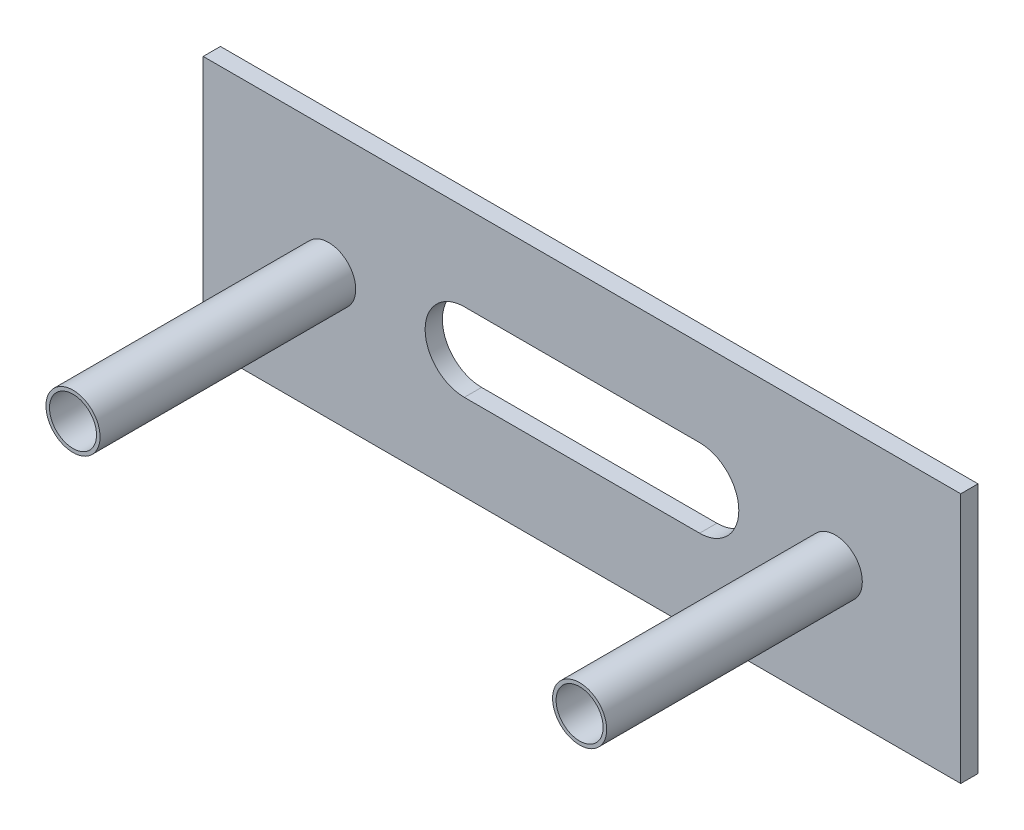
ISO-10303-21;
HEADER;
FILE_DESCRIPTION(('STEP AP214'),'2;1');
FILE_NAME('part.step','',(''),(''),'','','');
FILE_SCHEMA(('AUTOMOTIVE_DESIGN { 1 0 10303 214 1 1 1 1 }'));
ENDSEC;
DATA;
#1=APPLICATION_CONTEXT('core data for automotive mechanical design processes');
#2=APPLICATION_PROTOCOL_DEFINITION('international standard','automotive_design',2000,#1);
#3=PRODUCT_CONTEXT('',#1,'mechanical');
#4=PRODUCT('Part','Part','',(#3));
#5=PRODUCT_RELATED_PRODUCT_CATEGORY('part','',(#4));
#6=PRODUCT_DEFINITION_FORMATION('','',#4);
#7=PRODUCT_DEFINITION_CONTEXT('part definition',#1,'design');
#8=PRODUCT_DEFINITION('design','',#6,#7);
#9=PRODUCT_DEFINITION_SHAPE('','',#8);
#10=(LENGTH_UNIT() NAMED_UNIT(*) SI_UNIT(.MILLI.,.METRE.));
#11=(NAMED_UNIT(*) PLANE_ANGLE_UNIT() SI_UNIT($,.RADIAN.));
#12=(NAMED_UNIT(*) SI_UNIT($,.STERADIAN.) SOLID_ANGLE_UNIT());
#13=UNCERTAINTY_MEASURE_WITH_UNIT(LENGTH_MEASURE(1.E-05),#10,'distance_accuracy_value','');
#14=(GEOMETRIC_REPRESENTATION_CONTEXT(3) GLOBAL_UNCERTAINTY_ASSIGNED_CONTEXT((#13)) GLOBAL_UNIT_ASSIGNED_CONTEXT((#10,
#11,#12)) REPRESENTATION_CONTEXT('',''));
#15=CARTESIAN_POINT('',(0.,0.,0.));
#16=DIRECTION('',(0.,0.,1.));
#17=DIRECTION('',(1.,0.,0.));
#18=AXIS2_PLACEMENT_3D('',#15,#16,#17);
#19=CARTESIAN_POINT('',(-47.6288432611678,18.259938231017,2.2));
#20=DIRECTION('',(1.,0.,0.));
#21=DIRECTION('',(0.,0.,-1.));
#22=AXIS2_PLACEMENT_3D('',#19,#20,#21);
#23=PLANE('',#22);
#24=DIRECTION('',(0.,-1.,0.));
#25=VECTOR('',#24,1.);
#26=CARTESIAN_POINT('',(-47.6288432611678,18.259938231017,0.));
#27=LINE('',#26,#25);
#28=CARTESIAN_POINT('',(-47.6288432611678,18.259938231017,0.));
#29=VERTEX_POINT('',#28);
#30=CARTESIAN_POINT('',(-47.6288432611678,-13.740061768983,0.));
#31=VERTEX_POINT('',#30);
#32=EDGE_CURVE('E153',#29,#31,#27,.T.);
#33=ORIENTED_EDGE('',*,*,#32,.T.);
#34=DIRECTION('',(0.,0.,-1.));
#35=VECTOR('',#34,1.);
#36=CARTESIAN_POINT('',(-47.6288432611678,-13.740061768983,2.2));
#37=LINE('',#36,#35);
#38=CARTESIAN_POINT('',(-47.6288432611678,-13.740061768983,2.2));
#39=VERTEX_POINT('',#38);
#40=EDGE_CURVE('E11',#39,#31,#37,.T.);
#41=ORIENTED_EDGE('',*,*,#40,.F.);
#42=DIRECTION('',(0.,-1.,0.));
#43=VECTOR('',#42,1.);
#44=CARTESIAN_POINT('',(-47.6288432611678,18.259938231017,2.2));
#45=LINE('',#44,#43);
#46=CARTESIAN_POINT('',(-47.6288432611678,18.259938231017,2.2));
#47=VERTEX_POINT('',#46);
#48=EDGE_CURVE('E156',#47,#39,#45,.T.);
#49=ORIENTED_EDGE('',*,*,#48,.F.);
#50=DIRECTION('',(0.,0.,-1.));
#51=VECTOR('',#50,1.);
#52=CARTESIAN_POINT('',(-47.6288432611678,18.259938231017,2.2));
#53=LINE('',#52,#51);
#54=EDGE_CURVE('E166',#47,#29,#53,.T.);
#55=ORIENTED_EDGE('',*,*,#54,.T.);
#56=EDGE_LOOP('',(#33,#41,#49,#55));
#57=FACE_BOUND('',#56,.T.);
#58=ADVANCED_FACE('F39',(#57),#23,.F.);
#59=CARTESIAN_POINT('',(-47.6288432611678,-13.740061768983,2.2));
#60=DIRECTION('',(0.,1.,0.));
#61=DIRECTION('',(0.,0.,1.));
#62=AXIS2_PLACEMENT_3D('',#59,#60,#61);
#63=PLANE('',#62);
#64=DIRECTION('',(1.,0.,0.));
#65=VECTOR('',#64,1.);
#66=CARTESIAN_POINT('',(-47.6288432611678,-13.740061768983,0.));
#67=LINE('',#66,#65);
#68=CARTESIAN_POINT('',(48.9711567388322,-13.740061768983,0.));
#69=VERTEX_POINT('',#68);
#70=EDGE_CURVE('E169',#31,#69,#67,.T.);
#71=ORIENTED_EDGE('',*,*,#70,.T.);
#72=DIRECTION('',(0.,0.,-1.));
#73=VECTOR('',#72,1.);
#74=CARTESIAN_POINT('',(48.9711567388322,-13.740061768983,2.2));
#75=LINE('',#74,#73);
#76=CARTESIAN_POINT('',(48.9711567388322,-13.740061768983,2.2));
#77=VERTEX_POINT('',#76);
#78=EDGE_CURVE('E46',#77,#69,#75,.T.);
#79=ORIENTED_EDGE('',*,*,#78,.F.);
#80=DIRECTION('',(1.,0.,0.));
#81=VECTOR('',#80,1.);
#82=CARTESIAN_POINT('',(-47.6288432611678,-13.740061768983,2.2));
#83=LINE('',#82,#81);
#84=EDGE_CURVE('E159',#39,#77,#83,.T.);
#85=ORIENTED_EDGE('',*,*,#84,.F.);
#86=ORIENTED_EDGE('',*,*,#40,.T.);
#87=EDGE_LOOP('',(#71,#79,#85,#86));
#88=FACE_BOUND('',#87,.T.);
#89=ADVANCED_FACE('F197',(#88),#63,.F.);
#90=CARTESIAN_POINT('',(48.9711567388322,18.259938231017,2.2));
#91=DIRECTION('',(-1.,0.,0.));
#92=DIRECTION('',(0.,0.,1.));
#93=AXIS2_PLACEMENT_3D('',#90,#91,#92);
#94=PLANE('',#93);
#95=DIRECTION('',(0.,1.,0.));
#96=VECTOR('',#95,1.);
#97=CARTESIAN_POINT('',(48.9711567388322,18.259938231017,0.));
#98=LINE('',#97,#96);
#99=CARTESIAN_POINT('',(48.9711567388322,18.259938231017,0.));
#100=VERTEX_POINT('',#99);
#101=EDGE_CURVE('E171',#69,#100,#98,.T.);
#102=ORIENTED_EDGE('',*,*,#101,.T.);
#103=DIRECTION('',(0.,0.,-1.));
#104=VECTOR('',#103,1.);
#105=CARTESIAN_POINT('',(48.9711567388322,18.259938231017,2.2));
#106=LINE('',#105,#104);
#107=CARTESIAN_POINT('',(48.9711567388322,18.259938231017,2.2));
#108=VERTEX_POINT('',#107);
#109=EDGE_CURVE('E176',#108,#100,#106,.T.);
#110=ORIENTED_EDGE('',*,*,#109,.F.);
#111=DIRECTION('',(0.,1.,0.));
#112=VECTOR('',#111,1.);
#113=CARTESIAN_POINT('',(48.9711567388322,18.259938231017,2.2));
#114=LINE('',#113,#112);
#115=EDGE_CURVE('E162',#77,#108,#114,.T.);
#116=ORIENTED_EDGE('',*,*,#115,.F.);
#117=ORIENTED_EDGE('',*,*,#78,.T.);
#118=EDGE_LOOP('',(#102,#110,#116,#117));
#119=FACE_BOUND('',#118,.T.);
#120=ADVANCED_FACE('F183',(#119),#94,.F.);
#121=CARTESIAN_POINT('',(-47.6288432611678,18.259938231017,2.2));
#122=DIRECTION('',(0.,-1.,0.));
#123=DIRECTION('',(0.,0.,-1.));
#124=AXIS2_PLACEMENT_3D('',#121,#122,#123);
#125=PLANE('',#124);
#126=DIRECTION('',(-1.,0.,0.));
#127=VECTOR('',#126,1.);
#128=CARTESIAN_POINT('',(-47.6288432611678,18.259938231017,0.));
#129=LINE('',#128,#127);
#130=EDGE_CURVE('E160',#100,#29,#129,.T.);
#131=ORIENTED_EDGE('',*,*,#130,.T.);
#132=ORIENTED_EDGE('',*,*,#54,.F.);
#133=DIRECTION('',(-1.,0.,0.));
#134=VECTOR('',#133,1.);
#135=CARTESIAN_POINT('',(-47.6288432611678,18.259938231017,2.2));
#136=LINE('',#135,#134);
#137=EDGE_CURVE('E164',#108,#47,#136,.T.);
#138=ORIENTED_EDGE('',*,*,#137,.F.);
#139=ORIENTED_EDGE('',*,*,#109,.T.);
#140=EDGE_LOOP('',(#131,#132,#138,#139));
#141=FACE_BOUND('',#140,.T.);
#142=ADVANCED_FACE('F190',(#141),#125,.F.);
#143=CARTESIAN_POINT('',(0.,0.,2.2));
#144=DIRECTION('',(0.,0.,1.));
#145=DIRECTION('',(1.,0.,0.));
#146=AXIS2_PLACEMENT_3D('',#143,#144,#145);
#147=PLANE('',#146);
#148=CARTESIAN_POINT('',(-14.3288432611678,2.25993823101696,2.2));
#149=DIRECTION('',(0.,0.,1.));
#150=DIRECTION('',(1.,0.,0.));
#151=AXIS2_PLACEMENT_3D('',#148,#149,#150);
#152=CIRCLE('',#151,5.);
#153=CARTESIAN_POINT('',(-14.3288432611678,7.25993823101695,2.2));
#154=VERTEX_POINT('',#153);
#155=CARTESIAN_POINT('',(-14.3288432611678,-2.74006176898305,2.2));
#156=VERTEX_POINT('',#155);
#157=EDGE_CURVE('E109',#154,#156,#152,.T.);
#158=ORIENTED_EDGE('',*,*,#157,.F.);
#159=DIRECTION('',(-1.,0.,0.));
#160=VECTOR('',#159,1.);
#161=CARTESIAN_POINT('',(0.,7.25993823101696,2.2));
#162=LINE('',#161,#160);
#163=CARTESIAN_POINT('',(15.6711567388322,7.25993823101696,2.2));
#164=VERTEX_POINT('',#163);
#165=EDGE_CURVE('E140',#164,#154,#162,.T.);
#166=ORIENTED_EDGE('',*,*,#165,.F.);
#167=CARTESIAN_POINT('',(15.6711567388322,2.25993823101696,2.2));
#168=DIRECTION('',(0.,0.,1.));
#169=DIRECTION('',(1.,0.,0.));
#170=AXIS2_PLACEMENT_3D('',#167,#168,#169);
#171=CIRCLE('',#170,5.);
#172=CARTESIAN_POINT('',(15.6711567388322,-2.74006176898303,2.2));
#173=VERTEX_POINT('',#172);
#174=EDGE_CURVE('E137',#173,#164,#171,.T.);
#175=ORIENTED_EDGE('',*,*,#174,.F.);
#176=DIRECTION('',(1.,0.,0.));
#177=VECTOR('',#176,1.);
#178=CARTESIAN_POINT('',(0.,-2.74006176898304,2.2));
#179=LINE('',#178,#177);
#180=EDGE_CURVE('E135',#156,#173,#179,.T.);
#181=ORIENTED_EDGE('',*,*,#180,.F.);
#182=EDGE_LOOP('',(#158,#166,#175,#181));
#183=FACE_BOUND('',#182,.T.);
#184=CARTESIAN_POINT('',(32.9711567388322,2.25993823101696,2.2));
#185=DIRECTION('',(0.,0.,1.));
#186=DIRECTION('',(1.,0.,0.));
#187=AXIS2_PLACEMENT_3D('',#184,#185,#186);
#188=CIRCLE('',#187,3.45);
#189=CARTESIAN_POINT('',(36.4211567388322,2.25993823101696,2.2));
#190=VERTEX_POINT('',#189);
#191=EDGE_CURVE('E143',#190,#190,#188,.T.);
#192=ORIENTED_EDGE('',*,*,#191,.F.);
#193=EDGE_LOOP('',(#192));
#194=FACE_BOUND('',#193,.T.);
#195=CARTESIAN_POINT('',(-31.6288432611678,2.25993823101696,2.2));
#196=DIRECTION('',(0.,0.,1.));
#197=DIRECTION('',(1.,0.,0.));
#198=AXIS2_PLACEMENT_3D('',#195,#196,#197);
#199=CIRCLE('',#198,3.45);
#200=CARTESIAN_POINT('',(-28.1788432611678,2.25993823101696,2.2));
#201=VERTEX_POINT('',#200);
#202=EDGE_CURVE('E147',#201,#201,#199,.T.);
#203=ORIENTED_EDGE('',*,*,#202,.F.);
#204=EDGE_LOOP('',(#203));
#205=FACE_BOUND('',#204,.T.);
#206=ORIENTED_EDGE('',*,*,#48,.T.);
#207=ORIENTED_EDGE('',*,*,#84,.T.);
#208=ORIENTED_EDGE('',*,*,#115,.T.);
#209=ORIENTED_EDGE('',*,*,#137,.T.);
#210=EDGE_LOOP('',(#206,#207,#208,#209));
#211=FACE_BOUND('',#210,.T.);
#212=ADVANCED_FACE('F196',(#183,#194,#205,#211),#147,.T.);
#213=CARTESIAN_POINT('',(0.,0.,0.));
#214=DIRECTION('',(0.,0.,1.));
#215=DIRECTION('',(1.,0.,0.));
#216=AXIS2_PLACEMENT_3D('',#213,#214,#215);
#217=PLANE('',#216);
#218=CARTESIAN_POINT('',(-31.6288432611678,2.25993823101696,0.));
#219=DIRECTION('',(0.,0.,1.));
#220=DIRECTION('',(1.,0.,0.));
#221=AXIS2_PLACEMENT_3D('',#218,#219,#220);
#222=CIRCLE('',#221,3.);
#223=CARTESIAN_POINT('',(-28.6288432611678,2.25993823101696,0.));
#224=VERTEX_POINT('',#223);
#225=EDGE_CURVE('E138',#224,#224,#222,.T.);
#226=ORIENTED_EDGE('',*,*,#225,.T.);
#227=EDGE_LOOP('',(#226));
#228=FACE_BOUND('',#227,.T.);
#229=CARTESIAN_POINT('',(32.9711567388322,2.25993823101696,0.));
#230=DIRECTION('',(0.,0.,1.));
#231=DIRECTION('',(1.,0.,0.));
#232=AXIS2_PLACEMENT_3D('',#229,#230,#231);
#233=CIRCLE('',#232,3.);
#234=CARTESIAN_POINT('',(35.9711567388322,2.25993823101696,0.));
#235=VERTEX_POINT('',#234);
#236=EDGE_CURVE('E255',#235,#235,#233,.T.);
#237=ORIENTED_EDGE('',*,*,#236,.T.);
#238=EDGE_LOOP('',(#237));
#239=FACE_BOUND('',#238,.T.);
#240=DIRECTION('',(-1.,0.,0.));
#241=VECTOR('',#240,1.);
#242=CARTESIAN_POINT('',(-14.3288432611678,7.25993823101695,0.));
#243=LINE('',#242,#241);
#244=CARTESIAN_POINT('',(15.6711567388322,7.25993823101696,0.));
#245=VERTEX_POINT('',#244);
#246=CARTESIAN_POINT('',(-14.3288432611678,7.25993823101695,0.));
#247=VERTEX_POINT('',#246);
#248=EDGE_CURVE('E112',#245,#247,#243,.T.);
#249=ORIENTED_EDGE('',*,*,#248,.T.);
#250=CARTESIAN_POINT('',(-14.3288432611678,2.25993823101696,0.));
#251=DIRECTION('',(0.,0.,1.));
#252=DIRECTION('',(1.,0.,0.));
#253=AXIS2_PLACEMENT_3D('',#250,#251,#252);
#254=CIRCLE('',#253,5.);
#255=CARTESIAN_POINT('',(-14.3288432611678,-2.74006176898305,0.));
#256=VERTEX_POINT('',#255);
#257=EDGE_CURVE('E106',#247,#256,#254,.T.);
#258=ORIENTED_EDGE('',*,*,#257,.T.);
#259=DIRECTION('',(1.,0.,0.));
#260=VECTOR('',#259,1.);
#261=CARTESIAN_POINT('',(-14.3288432611678,-2.74006176898305,0.));
#262=LINE('',#261,#260);
#263=CARTESIAN_POINT('',(15.6711567388322,-2.74006176898304,0.));
#264=VERTEX_POINT('',#263);
#265=EDGE_CURVE('E115',#256,#264,#262,.T.);
#266=ORIENTED_EDGE('',*,*,#265,.T.);
#267=CARTESIAN_POINT('',(15.6711567388322,2.25993823101696,0.));
#268=DIRECTION('',(0.,0.,1.));
#269=DIRECTION('',(1.,0.,0.));
#270=AXIS2_PLACEMENT_3D('',#267,#268,#269);
#271=CIRCLE('',#270,5.);
#272=EDGE_CURVE('E61',#264,#245,#271,.T.);
#273=ORIENTED_EDGE('',*,*,#272,.T.);
#274=EDGE_LOOP('',(#249,#258,#266,#273));
#275=FACE_BOUND('',#274,.T.);
#276=ORIENTED_EDGE('',*,*,#32,.F.);
#277=ORIENTED_EDGE('',*,*,#130,.F.);
#278=ORIENTED_EDGE('',*,*,#101,.F.);
#279=ORIENTED_EDGE('',*,*,#70,.F.);
#280=EDGE_LOOP('',(#276,#277,#278,#279));
#281=FACE_BOUND('',#280,.T.);
#282=ADVANCED_FACE('F119',(#228,#239,#275,#281),#217,.F.);
#283=CARTESIAN_POINT('',(-31.6288432611678,2.25993823101696,34.8));
#284=DIRECTION('',(0.,0.,-1.));
#285=DIRECTION('',(-1.,0.,0.));
#286=AXIS2_PLACEMENT_3D('',#283,#284,#285);
#287=CYLINDRICAL_SURFACE('',#286,3.45);
#288=CARTESIAN_POINT('',(-31.6288432611678,2.25993823101696,34.8));
#289=DIRECTION('',(0.,0.,1.));
#290=DIRECTION('',(1.,0.,0.));
#291=AXIS2_PLACEMENT_3D('',#288,#289,#290);
#292=CIRCLE('',#291,3.45);
#293=CARTESIAN_POINT('',(-28.1788432611678,2.25993823101696,34.8));
#294=VERTEX_POINT('',#293);
#295=EDGE_CURVE('E150',#294,#294,#292,.T.);
#296=ORIENTED_EDGE('',*,*,#295,.F.);
#297=EDGE_LOOP('',(#296));
#298=FACE_BOUND('',#297,.T.);
#299=ORIENTED_EDGE('',*,*,#202,.T.);
#300=EDGE_LOOP('',(#299));
#301=FACE_BOUND('',#300,.T.);
#302=ADVANCED_FACE('F209',(#298,#301),#287,.T.);
#303=CARTESIAN_POINT('',(-31.6288432611678,2.25993823101696,34.8));
#304=DIRECTION('',(0.,0.,1.));
#305=DIRECTION('',(1.,0.,0.));
#306=AXIS2_PLACEMENT_3D('',#303,#304,#305);
#307=PLANE('',#306);
#308=CARTESIAN_POINT('',(-31.6288432611678,2.25993823101696,34.8));
#309=DIRECTION('',(0.,0.,1.));
#310=DIRECTION('',(1.,0.,0.));
#311=AXIS2_PLACEMENT_3D('',#308,#309,#310);
#312=CIRCLE('',#311,3.);
#313=CARTESIAN_POINT('',(-28.6288432611678,2.25993823101696,34.8));
#314=VERTEX_POINT('',#313);
#315=EDGE_CURVE('E254',#314,#314,#312,.T.);
#316=ORIENTED_EDGE('',*,*,#315,.F.);
#317=EDGE_LOOP('',(#316));
#318=FACE_BOUND('',#317,.T.);
#319=ORIENTED_EDGE('',*,*,#295,.T.);
#320=EDGE_LOOP('',(#319));
#321=FACE_BOUND('',#320,.T.);
#322=ADVANCED_FACE('F216',(#318,#321),#307,.T.);
#323=CARTESIAN_POINT('',(32.9711567388322,2.25993823101696,34.8));
#324=DIRECTION('',(0.,0.,-1.));
#325=DIRECTION('',(-1.,0.,0.));
#326=AXIS2_PLACEMENT_3D('',#323,#324,#325);
#327=CYLINDRICAL_SURFACE('',#326,3.45);
#328=CARTESIAN_POINT('',(32.9711567388322,2.25993823101696,34.8));
#329=DIRECTION('',(0.,0.,1.));
#330=DIRECTION('',(1.,0.,0.));
#331=AXIS2_PLACEMENT_3D('',#328,#329,#330);
#332=CIRCLE('',#331,3.45);
#333=CARTESIAN_POINT('',(36.4211567388322,2.25993823101696,34.8));
#334=VERTEX_POINT('',#333);
#335=EDGE_CURVE('E144',#334,#334,#332,.T.);
#336=ORIENTED_EDGE('',*,*,#335,.F.);
#337=EDGE_LOOP('',(#336));
#338=FACE_BOUND('',#337,.T.);
#339=ORIENTED_EDGE('',*,*,#191,.T.);
#340=EDGE_LOOP('',(#339));
#341=FACE_BOUND('',#340,.T.);
#342=ADVANCED_FACE('F220',(#338,#341),#327,.T.);
#343=CARTESIAN_POINT('',(32.9711567388322,2.25993823101696,34.8));
#344=DIRECTION('',(0.,0.,1.));
#345=DIRECTION('',(1.,0.,0.));
#346=AXIS2_PLACEMENT_3D('',#343,#344,#345);
#347=PLANE('',#346);
#348=CARTESIAN_POINT('',(32.9711567388322,2.25993823101696,34.8));
#349=DIRECTION('',(0.,0.,1.));
#350=DIRECTION('',(1.,0.,0.));
#351=AXIS2_PLACEMENT_3D('',#348,#349,#350);
#352=CIRCLE('',#351,3.);
#353=CARTESIAN_POINT('',(35.9711567388322,2.25993823101696,34.8));
#354=VERTEX_POINT('',#353);
#355=EDGE_CURVE('E124',#354,#354,#352,.T.);
#356=ORIENTED_EDGE('',*,*,#355,.F.);
#357=EDGE_LOOP('',(#356));
#358=FACE_BOUND('',#357,.T.);
#359=ORIENTED_EDGE('',*,*,#335,.T.);
#360=EDGE_LOOP('',(#359));
#361=FACE_BOUND('',#360,.T.);
#362=ADVANCED_FACE('F224',(#358,#361),#347,.T.);
#363=CARTESIAN_POINT('',(32.9711567388322,2.25993823101696,0.));
#364=DIRECTION('',(0.,0.,1.));
#365=DIRECTION('',(1.,0.,0.));
#366=AXIS2_PLACEMENT_3D('',#363,#364,#365);
#367=CYLINDRICAL_SURFACE('',#366,3.);
#368=ORIENTED_EDGE('',*,*,#236,.F.);
#369=EDGE_LOOP('',(#368));
#370=FACE_BOUND('',#369,.T.);
#371=ORIENTED_EDGE('',*,*,#355,.T.);
#372=EDGE_LOOP('',(#371));
#373=FACE_BOUND('',#372,.T.);
#374=ADVANCED_FACE('F228',(#370,#373),#367,.F.);
#375=CARTESIAN_POINT('',(-31.6288432611678,2.25993823101696,0.));
#376=DIRECTION('',(0.,0.,1.));
#377=DIRECTION('',(1.,0.,0.));
#378=AXIS2_PLACEMENT_3D('',#375,#376,#377);
#379=CYLINDRICAL_SURFACE('',#378,3.);
#380=ORIENTED_EDGE('',*,*,#225,.F.);
#381=EDGE_LOOP('',(#380));
#382=FACE_BOUND('',#381,.T.);
#383=ORIENTED_EDGE('',*,*,#315,.T.);
#384=EDGE_LOOP('',(#383));
#385=FACE_BOUND('',#384,.T.);
#386=ADVANCED_FACE('F233',(#382,#385),#379,.F.);
#387=CARTESIAN_POINT('',(-14.3288432611678,2.25993823101696,0.));
#388=DIRECTION('',(0.,0.,1.));
#389=DIRECTION('',(1.,0.,0.));
#390=AXIS2_PLACEMENT_3D('',#387,#388,#389);
#391=CYLINDRICAL_SURFACE('',#390,5.);
#392=ORIENTED_EDGE('',*,*,#157,.T.);
#393=DIRECTION('',(0.,0.,1.));
#394=VECTOR('',#393,1.);
#395=CARTESIAN_POINT('',(-14.3288432611678,-2.74006176898305,0.));
#396=LINE('',#395,#394);
#397=EDGE_CURVE('E53',#256,#156,#396,.T.);
#398=ORIENTED_EDGE('',*,*,#397,.F.);
#399=ORIENTED_EDGE('',*,*,#257,.F.);
#400=DIRECTION('',(0.,0.,1.));
#401=VECTOR('',#400,1.);
#402=CARTESIAN_POINT('',(-14.3288432611678,7.25993823101695,0.));
#403=LINE('',#402,#401);
#404=EDGE_CURVE('E129',#247,#154,#403,.T.);
#405=ORIENTED_EDGE('',*,*,#404,.T.);
#406=EDGE_LOOP('',(#392,#398,#399,#405));
#407=FACE_BOUND('',#406,.T.);
#408=ADVANCED_FACE('F103',(#407),#391,.F.);
#409=CARTESIAN_POINT('',(-14.3288432611678,7.25993823101695,0.));
#410=DIRECTION('',(0.,1.,0.));
#411=DIRECTION('',(-1.,0.,0.));
#412=AXIS2_PLACEMENT_3D('',#409,#410,#411);
#413=PLANE('',#412);
#414=ORIENTED_EDGE('',*,*,#165,.T.);
#415=ORIENTED_EDGE('',*,*,#404,.F.);
#416=ORIENTED_EDGE('',*,*,#248,.F.);
#417=DIRECTION('',(0.,0.,1.));
#418=VECTOR('',#417,1.);
#419=CARTESIAN_POINT('',(15.6711567388322,7.25993823101696,0.));
#420=LINE('',#419,#418);
#421=EDGE_CURVE('E131',#245,#164,#420,.T.);
#422=ORIENTED_EDGE('',*,*,#421,.T.);
#423=EDGE_LOOP('',(#414,#415,#416,#422));
#424=FACE_BOUND('',#423,.T.);
#425=ADVANCED_FACE('F232',(#424),#413,.F.);
#426=CARTESIAN_POINT('',(15.6711567388322,2.25993823101696,0.));
#427=DIRECTION('',(0.,0.,1.));
#428=DIRECTION('',(1.,0.,0.));
#429=AXIS2_PLACEMENT_3D('',#426,#427,#428);
#430=CYLINDRICAL_SURFACE('',#429,5.);
#431=ORIENTED_EDGE('',*,*,#174,.T.);
#432=ORIENTED_EDGE('',*,*,#421,.F.);
#433=ORIENTED_EDGE('',*,*,#272,.F.);
#434=DIRECTION('',(0.,0.,1.));
#435=VECTOR('',#434,1.);
#436=CARTESIAN_POINT('',(15.6711567388322,-2.74006176898303,0.));
#437=LINE('',#436,#435);
#438=EDGE_CURVE('E111',#264,#173,#437,.T.);
#439=ORIENTED_EDGE('',*,*,#438,.T.);
#440=EDGE_LOOP('',(#431,#432,#433,#439));
#441=FACE_BOUND('',#440,.T.);
#442=ADVANCED_FACE('F236',(#441),#430,.F.);
#443=CARTESIAN_POINT('',(-14.3288432611678,-2.74006176898305,0.));
#444=DIRECTION('',(0.,-1.,0.));
#445=DIRECTION('',(1.,0.,0.));
#446=AXIS2_PLACEMENT_3D('',#443,#444,#445);
#447=PLANE('',#446);
#448=ORIENTED_EDGE('',*,*,#180,.T.);
#449=ORIENTED_EDGE('',*,*,#438,.F.);
#450=ORIENTED_EDGE('',*,*,#265,.F.);
#451=ORIENTED_EDGE('',*,*,#397,.T.);
#452=EDGE_LOOP('',(#448,#449,#450,#451));
#453=FACE_BOUND('',#452,.T.);
#454=ADVANCED_FACE('F116',(#453),#447,.F.);
#455=CLOSED_SHELL('',(#58,#89,#120,#142,#212,#282,#302,#322,#342,#362,#374,#386,#408,#425,#442,#454));
#456=MANIFOLD_SOLID_BREP('B2',#455);
#457=ADVANCED_BREP_SHAPE_REPRESENTATION('',(#18,#456),#14);
#458=SHAPE_DEFINITION_REPRESENTATION(#9,#457);
ENDSEC;
END-ISO-10303-21;
